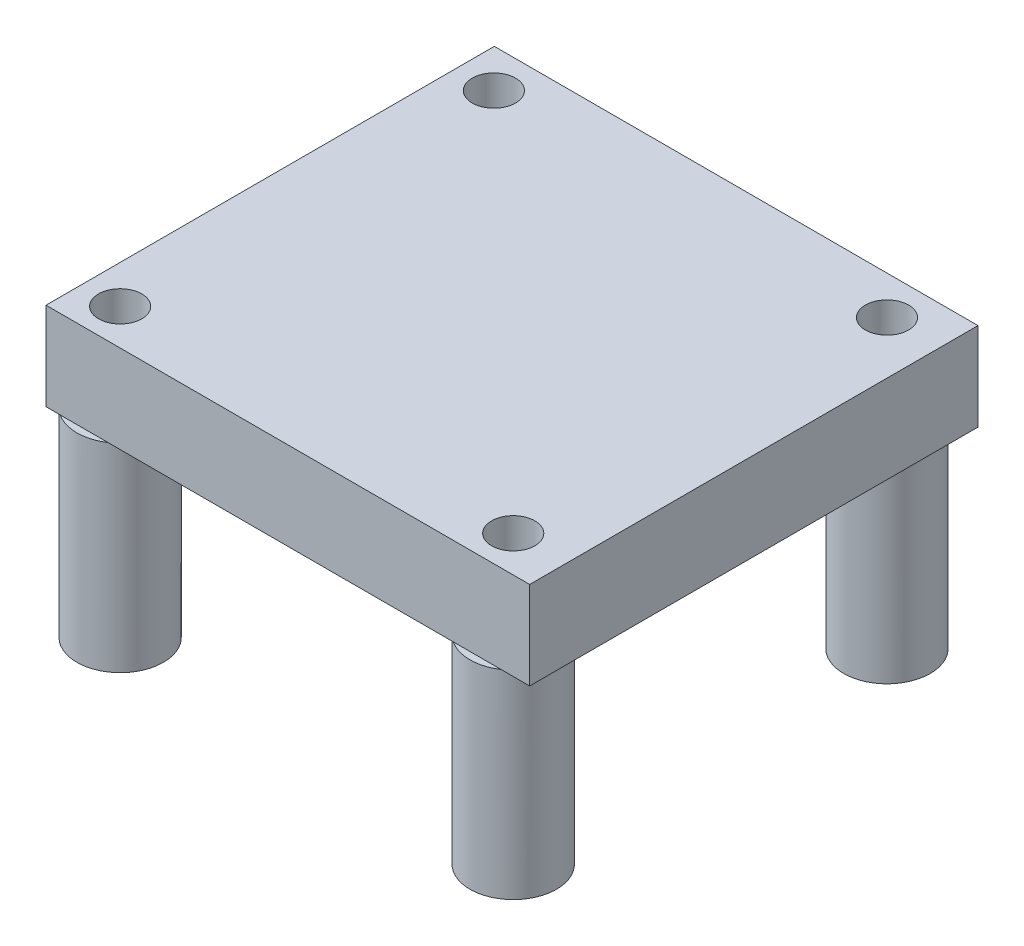
ISO-10303-21;
HEADER;
FILE_DESCRIPTION(('STEP AP214'),'2;1');
FILE_NAME('part.step','',(''),(''),'','','');
FILE_SCHEMA(('AUTOMOTIVE_DESIGN { 1 0 10303 214 1 1 1 1 }'));
ENDSEC;
DATA;
#1=APPLICATION_CONTEXT('core data for automotive mechanical design processes');
#2=APPLICATION_PROTOCOL_DEFINITION('international standard','automotive_design',2000,#1);
#3=PRODUCT_CONTEXT('',#1,'mechanical');
#4=PRODUCT('Part','Part','',(#3));
#5=PRODUCT_RELATED_PRODUCT_CATEGORY('part','',(#4));
#6=PRODUCT_DEFINITION_FORMATION('','',#4);
#7=PRODUCT_DEFINITION_CONTEXT('part definition',#1,'design');
#8=PRODUCT_DEFINITION('design','',#6,#7);
#9=PRODUCT_DEFINITION_SHAPE('','',#8);
#10=(LENGTH_UNIT() NAMED_UNIT(*) SI_UNIT(.MILLI.,.METRE.));
#11=(NAMED_UNIT(*) PLANE_ANGLE_UNIT() SI_UNIT($,.RADIAN.));
#12=(NAMED_UNIT(*) SI_UNIT($,.STERADIAN.) SOLID_ANGLE_UNIT());
#13=UNCERTAINTY_MEASURE_WITH_UNIT(LENGTH_MEASURE(1.E-05),#10,'distance_accuracy_value','');
#14=(GEOMETRIC_REPRESENTATION_CONTEXT(3) GLOBAL_UNCERTAINTY_ASSIGNED_CONTEXT((#13)) GLOBAL_UNIT_ASSIGNED_CONTEXT((#10,
#11,#12)) REPRESENTATION_CONTEXT('',''));
#15=CARTESIAN_POINT('',(0.,0.,0.));
#16=DIRECTION('',(0.,0.,1.));
#17=DIRECTION('',(1.,0.,0.));
#18=AXIS2_PLACEMENT_3D('',#15,#16,#17);
#19=CARTESIAN_POINT('',(0.,0.,0.));
#20=DIRECTION('',(0.,1.,0.));
#21=DIRECTION('',(0.,0.,1.));
#22=AXIS2_PLACEMENT_3D('',#19,#20,#21);
#23=PLANE('',#22);
#24=CARTESIAN_POINT('',(-9.08269961067136,0.,-8.40305308869703));
#25=DIRECTION('',(0.,1.,0.));
#26=DIRECTION('',(0.,0.,1.));
#27=AXIS2_PLACEMENT_3D('',#24,#25,#26);
#28=CIRCLE('',#27,2.5);
#29=CARTESIAN_POINT('',(-11.2828992805755,0.,-9.59011728769957));
#30=VERTEX_POINT('',#29);
#31=CARTESIAN_POINT('',(-10.2204199898374,0.,-10.6291690647482));
#32=VERTEX_POINT('',#31);
#33=EDGE_CURVE('E11',#30,#32,#28,.F.);
#34=ORIENTED_EDGE('',*,*,#33,.F.);
#35=DIRECTION('',(0.,0.,1.));
#36=VECTOR('',#35,1.);
#37=CARTESIAN_POINT('',(-11.2828992805755,0.,-10.6291690647482));
#38=LINE('',#37,#36);
#39=CARTESIAN_POINT('',(-11.2828992805755,0.,-10.6291690647482));
#40=VERTEX_POINT('',#39);
#41=EDGE_CURVE('E185',#40,#30,#38,.T.);
#42=ORIENTED_EDGE('',*,*,#41,.F.);
#43=DIRECTION('',(-1.,0.,0.));
#44=VECTOR('',#43,1.);
#45=CARTESIAN_POINT('',(-11.2828992805755,0.,-10.6291690647482));
#46=LINE('',#45,#44);
#47=EDGE_CURVE('E59',#32,#40,#46,.T.);
#48=ORIENTED_EDGE('',*,*,#47,.F.);
#49=EDGE_LOOP('',(#34,#42,#48));
#50=FACE_BOUND('',#49,.T.);
#51=ADVANCED_FACE('F36',(#50),#23,.F.);
#52=CARTESIAN_POINT('',(-9.08269961067136,0.,13.186946911303));
#53=DIRECTION('',(0.,-1.,0.));
#54=DIRECTION('',(0.,0.,-1.));
#55=AXIS2_PLACEMENT_3D('',#52,#53,#54);
#56=CIRCLE('',#55,2.5);
#57=CARTESIAN_POINT('',(-10.4637960500017,0.,15.2708309352518));
#58=VERTEX_POINT('',#57);
#59=CARTESIAN_POINT('',(-11.2828992805755,0.,14.3740111103055));
#60=VERTEX_POINT('',#59);
#61=EDGE_CURVE('E208',#58,#60,#56,.T.);
#62=ORIENTED_EDGE('',*,*,#61,.F.);
#63=DIRECTION('',(1.,0.,0.));
#64=VECTOR('',#63,1.);
#65=CARTESIAN_POINT('',(-11.2828992805755,0.,15.2708309352518));
#66=LINE('',#65,#64);
#67=CARTESIAN_POINT('',(-11.2828992805755,0.,15.2708309352518));
#68=VERTEX_POINT('',#67);
#69=EDGE_CURVE('E192',#68,#58,#66,.T.);
#70=ORIENTED_EDGE('',*,*,#69,.F.);
#71=EDGE_CURVE('E170',#60,#68,#38,.T.);
#72=ORIENTED_EDGE('',*,*,#71,.F.);
#73=EDGE_LOOP('',(#62,#70,#72));
#74=FACE_BOUND('',#73,.T.);
#75=ADVANCED_FACE('F242',(#74),#23,.F.);
#76=CARTESIAN_POINT('',(-11.2828992805755,5.08,-10.6291690647482));
#77=DIRECTION('',(1.,0.,0.));
#78=DIRECTION('',(0.,0.,-1.));
#79=AXIS2_PLACEMENT_3D('',#76,#77,#78);
#80=PLANE('',#79);
#81=ORIENTED_EDGE('',*,*,#41,.T.);
#82=CARTESIAN_POINT('',(-11.2828992805755,0.,-7.21598888969449));
#83=VERTEX_POINT('',#82);
#84=EDGE_CURVE('E189',#30,#83,#38,.T.);
#85=ORIENTED_EDGE('',*,*,#84,.T.);
#86=CARTESIAN_POINT('',(-11.2828992805755,0.,11.9998827123004));
#87=VERTEX_POINT('',#86);
#88=EDGE_CURVE('E190',#83,#87,#38,.T.);
#89=ORIENTED_EDGE('',*,*,#88,.T.);
#90=EDGE_CURVE('E191',#87,#60,#38,.T.);
#91=ORIENTED_EDGE('',*,*,#90,.T.);
#92=ORIENTED_EDGE('',*,*,#71,.T.);
#93=DIRECTION('',(0.,-1.,0.));
#94=VECTOR('',#93,1.);
#95=CARTESIAN_POINT('',(-11.2828992805755,5.08,15.2708309352518));
#96=LINE('',#95,#94);
#97=CARTESIAN_POINT('',(-11.2828992805755,5.08,15.2708309352518));
#98=VERTEX_POINT('',#97);
#99=EDGE_CURVE('E205',#98,#68,#96,.T.);
#100=ORIENTED_EDGE('',*,*,#99,.F.);
#101=DIRECTION('',(0.,0.,1.));
#102=VECTOR('',#101,1.);
#103=CARTESIAN_POINT('',(-11.2828992805755,5.08,-10.6291690647482));
#104=LINE('',#103,#102);
#105=CARTESIAN_POINT('',(-11.2828992805755,5.08,-10.6291690647482));
#106=VERTEX_POINT('',#105);
#107=EDGE_CURVE('E175',#106,#98,#104,.T.);
#108=ORIENTED_EDGE('',*,*,#107,.F.);
#109=DIRECTION('',(0.,-1.,0.));
#110=VECTOR('',#109,1.);
#111=CARTESIAN_POINT('',(-11.2828992805755,5.08,-10.6291690647482));
#112=LINE('',#111,#110);
#113=EDGE_CURVE('E184',#106,#40,#112,.T.);
#114=ORIENTED_EDGE('',*,*,#113,.T.);
#115=EDGE_LOOP('',(#81,#85,#89,#91,#92,#100,#108,#114));
#116=FACE_BOUND('',#115,.T.);
#117=ADVANCED_FACE('F38',(#116),#80,.F.);
#118=CARTESIAN_POINT('',(-11.2828992805755,5.08,15.2708309352518));
#119=DIRECTION('',(0.,0.,-1.));
#120=DIRECTION('',(-1.,0.,0.));
#121=AXIS2_PLACEMENT_3D('',#118,#119,#120);
#122=PLANE('',#121);
#123=ORIENTED_EDGE('',*,*,#69,.T.);
#124=CARTESIAN_POINT('',(-7.70160317134106,0.,15.2708309352518));
#125=VERTEX_POINT('',#124);
#126=EDGE_CURVE('E196',#58,#125,#66,.T.);
#127=ORIENTED_EDGE('',*,*,#126,.T.);
#128=CARTESIAN_POINT('',(12.2438039499983,0.,15.2708309352518));
#129=VERTEX_POINT('',#128);
#130=EDGE_CURVE('E353',#125,#129,#66,.T.);
#131=ORIENTED_EDGE('',*,*,#130,.T.);
#132=CARTESIAN_POINT('',(15.0059968286589,0.,15.2708309352518));
#133=VERTEX_POINT('',#132);
#134=EDGE_CURVE('E352',#129,#133,#66,.T.);
#135=ORIENTED_EDGE('',*,*,#134,.T.);
#136=CARTESIAN_POINT('',(16.6571007194245,0.,15.2708309352518));
#137=VERTEX_POINT('',#136);
#138=EDGE_CURVE('E188',#133,#137,#66,.T.);
#139=ORIENTED_EDGE('',*,*,#138,.T.);
#140=DIRECTION('',(0.,-1.,0.));
#141=VECTOR('',#140,1.);
#142=CARTESIAN_POINT('',(16.6571007194245,5.08,15.2708309352518));
#143=LINE('',#142,#141);
#144=CARTESIAN_POINT('',(16.6571007194245,5.08,15.2708309352518));
#145=VERTEX_POINT('',#144);
#146=EDGE_CURVE('E202',#145,#137,#143,.T.);
#147=ORIENTED_EDGE('',*,*,#146,.F.);
#148=DIRECTION('',(1.,0.,0.));
#149=VECTOR('',#148,1.);
#150=CARTESIAN_POINT('',(-11.2828992805755,5.08,15.2708309352518));
#151=LINE('',#150,#149);
#152=EDGE_CURVE('E178',#98,#145,#151,.T.);
#153=ORIENTED_EDGE('',*,*,#152,.F.);
#154=ORIENTED_EDGE('',*,*,#99,.T.);
#155=EDGE_LOOP('',(#123,#127,#131,#135,#139,#147,#153,#154));
#156=FACE_BOUND('',#155,.T.);
#157=ADVANCED_FACE('F344',(#156),#122,.F.);
#158=CARTESIAN_POINT('',(16.6571007194245,5.08,-10.6291690647482));
#159=DIRECTION('',(-1.,0.,0.));
#160=DIRECTION('',(0.,0.,1.));
#161=AXIS2_PLACEMENT_3D('',#158,#159,#160);
#162=PLANE('',#161);
#163=DIRECTION('',(0.,0.,-1.));
#164=VECTOR('',#163,1.);
#165=CARTESIAN_POINT('',(16.6571007194245,0.,-10.6291690647482));
#166=LINE('',#165,#164);
#167=CARTESIAN_POINT('',(16.6571007194245,0.,-10.6291690647482));
#168=VERTEX_POINT('',#167);
#169=EDGE_CURVE('E195',#137,#168,#166,.T.);
#170=ORIENTED_EDGE('',*,*,#169,.T.);
#171=DIRECTION('',(0.,-1.,0.));
#172=VECTOR('',#171,1.);
#173=CARTESIAN_POINT('',(16.6571007194245,5.08,-10.6291690647482));
#174=LINE('',#173,#172);
#175=CARTESIAN_POINT('',(16.6571007194245,5.08,-10.6291690647482));
#176=VERTEX_POINT('',#175);
#177=EDGE_CURVE('E200',#176,#168,#174,.T.);
#178=ORIENTED_EDGE('',*,*,#177,.F.);
#179=DIRECTION('',(0.,0.,-1.));
#180=VECTOR('',#179,1.);
#181=CARTESIAN_POINT('',(16.6571007194245,5.08,-10.6291690647482));
#182=LINE('',#181,#180);
#183=EDGE_CURVE('E180',#145,#176,#182,.T.);
#184=ORIENTED_EDGE('',*,*,#183,.F.);
#185=ORIENTED_EDGE('',*,*,#146,.T.);
#186=EDGE_LOOP('',(#170,#178,#184,#185));
#187=FACE_BOUND('',#186,.T.);
#188=ADVANCED_FACE('F263',(#187),#162,.F.);
#189=CARTESIAN_POINT('',(-11.2828992805755,5.08,-10.6291690647482));
#190=DIRECTION('',(0.,0.,1.));
#191=DIRECTION('',(1.,0.,0.));
#192=AXIS2_PLACEMENT_3D('',#189,#190,#191);
#193=PLANE('',#192);
#194=CARTESIAN_POINT('',(14.7626207684947,0.,-10.6291690647482));
#195=VERTEX_POINT('',#194);
#196=EDGE_CURVE('E119',#168,#195,#46,.T.);
#197=ORIENTED_EDGE('',*,*,#196,.T.);
#198=CARTESIAN_POINT('',(12.4871800101626,0.,-10.6291690647482));
#199=VERTEX_POINT('',#198);
#200=EDGE_CURVE('E114',#195,#199,#46,.T.);
#201=ORIENTED_EDGE('',*,*,#200,.T.);
#202=CARTESIAN_POINT('',(-7.94497923150531,0.,-10.6291690647482));
#203=VERTEX_POINT('',#202);
#204=EDGE_CURVE('E116',#199,#203,#46,.T.);
#205=ORIENTED_EDGE('',*,*,#204,.T.);
#206=EDGE_CURVE('E129',#203,#32,#46,.T.);
#207=ORIENTED_EDGE('',*,*,#206,.T.);
#208=ORIENTED_EDGE('',*,*,#47,.T.);
#209=ORIENTED_EDGE('',*,*,#113,.F.);
#210=DIRECTION('',(-1.,0.,0.));
#211=VECTOR('',#210,1.);
#212=CARTESIAN_POINT('',(-11.2828992805755,5.08,-10.6291690647482));
#213=LINE('',#212,#211);
#214=EDGE_CURVE('E182',#176,#106,#213,.T.);
#215=ORIENTED_EDGE('',*,*,#214,.F.);
#216=ORIENTED_EDGE('',*,*,#177,.T.);
#217=EDGE_LOOP('',(#197,#201,#205,#207,#208,#209,#215,#216));
#218=FACE_BOUND('',#217,.T.);
#219=ADVANCED_FACE('F115',(#218),#193,.F.);
#220=CARTESIAN_POINT('',(0.,5.08,0.));
#221=DIRECTION('',(0.,1.,0.));
#222=DIRECTION('',(0.,0.,1.));
#223=AXIS2_PLACEMENT_3D('',#220,#221,#222);
#224=PLANE('',#223);
#225=CARTESIAN_POINT('',(-9.08269961067136,5.08,-8.40305308869703));
#226=DIRECTION('',(0.,1.,0.));
#227=DIRECTION('',(0.,0.,1.));
#228=AXIS2_PLACEMENT_3D('',#225,#226,#227);
#229=CIRCLE('',#228,1.25);
#230=CARTESIAN_POINT('',(-9.08269961067136,5.08,-7.15305308869703));
#231=VERTEX_POINT('',#230);
#232=EDGE_CURVE('E329',#231,#231,#229,.T.);
#233=ORIENTED_EDGE('',*,*,#232,.F.);
#234=EDGE_LOOP('',(#233));
#235=FACE_BOUND('',#234,.T.);
#236=CARTESIAN_POINT('',(13.6249003893286,5.08,13.186946911303));
#237=DIRECTION('',(0.,1.,0.));
#238=DIRECTION('',(0.,0.,1.));
#239=AXIS2_PLACEMENT_3D('',#236,#237,#238);
#240=CIRCLE('',#239,1.25);
#241=CARTESIAN_POINT('',(13.6249003893286,5.08,14.436946911303));
#242=VERTEX_POINT('',#241);
#243=EDGE_CURVE('E331',#242,#242,#240,.T.);
#244=ORIENTED_EDGE('',*,*,#243,.F.);
#245=EDGE_LOOP('',(#244));
#246=FACE_BOUND('',#245,.T.);
#247=CARTESIAN_POINT('',(-9.08269961067136,5.08,13.186946911303));
#248=DIRECTION('',(0.,1.,0.));
#249=DIRECTION('',(0.,0.,1.));
#250=AXIS2_PLACEMENT_3D('',#247,#248,#249);
#251=CIRCLE('',#250,1.25);
#252=CARTESIAN_POINT('',(-9.08269961067136,5.08,14.436946911303));
#253=VERTEX_POINT('',#252);
#254=EDGE_CURVE('E335',#253,#253,#251,.T.);
#255=ORIENTED_EDGE('',*,*,#254,.F.);
#256=EDGE_LOOP('',(#255));
#257=FACE_BOUND('',#256,.T.);
#258=CARTESIAN_POINT('',(13.6249003893286,5.08,-8.40305308869703));
#259=DIRECTION('',(0.,1.,0.));
#260=DIRECTION('',(0.,0.,1.));
#261=AXIS2_PLACEMENT_3D('',#258,#259,#260);
#262=CIRCLE('',#261,1.25);
#263=CARTESIAN_POINT('',(13.6249003893286,5.08,-7.15305308869703));
#264=VERTEX_POINT('',#263);
#265=EDGE_CURVE('E142',#264,#264,#262,.T.);
#266=ORIENTED_EDGE('',*,*,#265,.F.);
#267=EDGE_LOOP('',(#266));
#268=FACE_BOUND('',#267,.T.);
#269=ORIENTED_EDGE('',*,*,#107,.T.);
#270=ORIENTED_EDGE('',*,*,#152,.T.);
#271=ORIENTED_EDGE('',*,*,#183,.T.);
#272=ORIENTED_EDGE('',*,*,#214,.T.);
#273=EDGE_LOOP('',(#269,#270,#271,#272));
#274=FACE_BOUND('',#273,.T.);
#275=ADVANCED_FACE('F251',(#235,#246,#257,#268,#274),#224,.T.);
#276=CARTESIAN_POINT('',(13.6249003893286,0.,-8.40305308869703));
#277=DIRECTION('',(0.,-1.,0.));
#278=DIRECTION('',(0.,0.,-1.));
#279=AXIS2_PLACEMENT_3D('',#276,#277,#278);
#280=CIRCLE('',#279,2.5);
#281=EDGE_CURVE('E51',#195,#199,#280,.T.);
#282=ORIENTED_EDGE('',*,*,#281,.F.);
#283=ORIENTED_EDGE('',*,*,#196,.F.);
#284=ORIENTED_EDGE('',*,*,#169,.F.);
#285=ORIENTED_EDGE('',*,*,#138,.F.);
#286=CARTESIAN_POINT('',(13.6249003893286,0.,13.186946911303));
#287=DIRECTION('',(0.,1.,0.));
#288=DIRECTION('',(0.,0.,1.));
#289=AXIS2_PLACEMENT_3D('',#286,#287,#288);
#290=CIRCLE('',#289,2.5);
#291=EDGE_CURVE('E44',#129,#133,#290,.F.);
#292=ORIENTED_EDGE('',*,*,#291,.F.);
#293=ORIENTED_EDGE('',*,*,#130,.F.);
#294=EDGE_CURVE('E174',#87,#125,#56,.T.);
#295=ORIENTED_EDGE('',*,*,#294,.F.);
#296=ORIENTED_EDGE('',*,*,#88,.F.);
#297=CARTESIAN_POINT('',(-9.08269961067136,0.,-8.40305308869703));
#298=DIRECTION('',(0.,-1.,0.));
#299=DIRECTION('',(0.,0.,-1.));
#300=AXIS2_PLACEMENT_3D('',#297,#298,#299);
#301=CIRCLE('',#300,2.5);
#302=EDGE_CURVE('E127',#203,#83,#301,.T.);
#303=ORIENTED_EDGE('',*,*,#302,.F.);
#304=ORIENTED_EDGE('',*,*,#204,.F.);
#305=EDGE_LOOP('',(#282,#283,#284,#285,#292,#293,#295,#296,#303,#304));
#306=FACE_BOUND('',#305,.T.);
#307=ADVANCED_FACE('F124',(#306),#23,.F.);
#308=CARTESIAN_POINT('',(-9.08269961067136,0.,13.186946911303));
#309=DIRECTION('',(0.,-1.,0.));
#310=DIRECTION('',(0.,0.,-1.));
#311=AXIS2_PLACEMENT_3D('',#308,#309,#310);
#312=PLANE('',#311);
#313=ORIENTED_EDGE('',*,*,#90,.F.);
#314=EDGE_CURVE('E166',#60,#87,#56,.T.);
#315=ORIENTED_EDGE('',*,*,#314,.F.);
#316=EDGE_LOOP('',(#313,#315));
#317=FACE_BOUND('',#316,.T.);
#318=ADVANCED_FACE('F221',(#317),#312,.F.);
#319=CARTESIAN_POINT('',(-9.08269961067136,-11.4808,13.186946911303));
#320=DIRECTION('',(0.,-1.,0.));
#321=DIRECTION('',(0.,0.,-1.));
#322=AXIS2_PLACEMENT_3D('',#319,#320,#321);
#323=PLANE('',#322);
#324=CARTESIAN_POINT('',(-9.08269961067136,-11.4808,13.186946911303));
#325=DIRECTION('',(0.,-1.,0.));
#326=DIRECTION('',(0.,0.,-1.));
#327=AXIS2_PLACEMENT_3D('',#324,#325,#326);
#328=CIRCLE('',#327,2.5);
#329=CARTESIAN_POINT('',(-9.08269961067136,-11.4808,10.686946911303));
#330=VERTEX_POINT('',#329);
#331=EDGE_CURVE('E167',#330,#330,#328,.T.);
#332=ORIENTED_EDGE('',*,*,#331,.T.);
#333=EDGE_LOOP('',(#332));
#334=FACE_BOUND('',#333,.T.);
#335=CARTESIAN_POINT('',(-9.08269961067136,-11.4808,13.186946911303));
#336=DIRECTION('',(0.,-1.,0.));
#337=DIRECTION('',(0.,0.,-1.));
#338=AXIS2_PLACEMENT_3D('',#335,#336,#337);
#339=CIRCLE('',#338,1.25);
#340=CARTESIAN_POINT('',(-9.08269961067136,-11.4808,11.936946911303));
#341=VERTEX_POINT('',#340);
#342=EDGE_CURVE('E163',#341,#341,#339,.T.);
#343=ORIENTED_EDGE('',*,*,#342,.F.);
#344=EDGE_LOOP('',(#343));
#345=FACE_BOUND('',#344,.T.);
#346=ADVANCED_FACE('F256',(#334,#345),#323,.T.);
#347=ORIENTED_EDGE('',*,*,#126,.F.);
#348=EDGE_CURVE('E171',#125,#58,#56,.T.);
#349=ORIENTED_EDGE('',*,*,#348,.F.);
#350=EDGE_LOOP('',(#347,#349));
#351=FACE_BOUND('',#350,.T.);
#352=ADVANCED_FACE('F258',(#351),#312,.F.);
#353=CARTESIAN_POINT('',(-9.08269961067136,-11.4808,13.186946911303));
#354=DIRECTION('',(0.,1.,0.));
#355=DIRECTION('',(0.,0.,1.));
#356=AXIS2_PLACEMENT_3D('',#353,#354,#355);
#357=CYLINDRICAL_SURFACE('',#356,2.5);
#358=ORIENTED_EDGE('',*,*,#331,.F.);
#359=EDGE_LOOP('',(#358));
#360=FACE_BOUND('',#359,.T.);
#361=ORIENTED_EDGE('',*,*,#348,.T.);
#362=ORIENTED_EDGE('',*,*,#61,.T.);
#363=ORIENTED_EDGE('',*,*,#314,.T.);
#364=ORIENTED_EDGE('',*,*,#294,.T.);
#365=EDGE_LOOP('',(#361,#362,#363,#364));
#366=FACE_BOUND('',#365,.T.);
#367=ADVANCED_FACE('F216',(#360,#366),#357,.T.);
#368=CARTESIAN_POINT('',(-9.08269961067136,-11.4808,13.186946911303));
#369=DIRECTION('',(0.,1.,0.));
#370=DIRECTION('',(0.,0.,1.));
#371=AXIS2_PLACEMENT_3D('',#368,#369,#370);
#372=CYLINDRICAL_SURFACE('',#371,1.25);
#373=ORIENTED_EDGE('',*,*,#342,.T.);
#374=EDGE_LOOP('',(#373));
#375=FACE_BOUND('',#374,.T.);
#376=ORIENTED_EDGE('',*,*,#254,.T.);
#377=EDGE_LOOP('',(#376));
#378=FACE_BOUND('',#377,.T.);
#379=ADVANCED_FACE('F268',(#375,#378),#372,.F.);
#380=CARTESIAN_POINT('',(13.6249003893286,0.,13.186946911303));
#381=DIRECTION('',(0.,-1.,0.));
#382=DIRECTION('',(0.,0.,-1.));
#383=AXIS2_PLACEMENT_3D('',#380,#381,#382);
#384=PLANE('',#383);
#385=CARTESIAN_POINT('',(13.6249003893286,0.,13.186946911303));
#386=DIRECTION('',(0.,-1.,0.));
#387=DIRECTION('',(0.,0.,-1.));
#388=AXIS2_PLACEMENT_3D('',#385,#386,#387);
#389=CIRCLE('',#388,2.5);
#390=EDGE_CURVE('E155',#133,#129,#389,.T.);
#391=ORIENTED_EDGE('',*,*,#390,.F.);
#392=ORIENTED_EDGE('',*,*,#134,.F.);
#393=EDGE_LOOP('',(#391,#392));
#394=FACE_BOUND('',#393,.T.);
#395=ADVANCED_FACE('F278',(#394),#384,.F.);
#396=CARTESIAN_POINT('',(13.6249003893286,-11.4808,13.186946911303));
#397=DIRECTION('',(0.,-1.,0.));
#398=DIRECTION('',(0.,0.,-1.));
#399=AXIS2_PLACEMENT_3D('',#396,#397,#398);
#400=PLANE('',#399);
#401=CARTESIAN_POINT('',(13.6249003893286,-11.4808,13.186946911303));
#402=DIRECTION('',(0.,-1.,0.));
#403=DIRECTION('',(0.,0.,-1.));
#404=AXIS2_PLACEMENT_3D('',#401,#402,#403);
#405=CIRCLE('',#404,2.5);
#406=CARTESIAN_POINT('',(13.6249003893286,-11.4808,10.686946911303));
#407=VERTEX_POINT('',#406);
#408=EDGE_CURVE('E154',#407,#407,#405,.T.);
#409=ORIENTED_EDGE('',*,*,#408,.T.);
#410=EDGE_LOOP('',(#409));
#411=FACE_BOUND('',#410,.T.);
#412=CARTESIAN_POINT('',(13.6249003893286,-11.4808,13.186946911303));
#413=DIRECTION('',(0.,-1.,0.));
#414=DIRECTION('',(0.,0.,-1.));
#415=AXIS2_PLACEMENT_3D('',#412,#413,#414);
#416=CIRCLE('',#415,1.25);
#417=CARTESIAN_POINT('',(13.6249003893286,-11.4808,11.936946911303));
#418=VERTEX_POINT('',#417);
#419=EDGE_CURVE('E158',#418,#418,#416,.T.);
#420=ORIENTED_EDGE('',*,*,#419,.F.);
#421=EDGE_LOOP('',(#420));
#422=FACE_BOUND('',#421,.T.);
#423=ADVANCED_FACE('F285',(#411,#422),#400,.T.);
#424=CARTESIAN_POINT('',(13.6249003893286,-11.4808,13.186946911303));
#425=DIRECTION('',(0.,1.,0.));
#426=DIRECTION('',(0.,0.,1.));
#427=AXIS2_PLACEMENT_3D('',#424,#425,#426);
#428=CYLINDRICAL_SURFACE('',#427,2.5);
#429=ORIENTED_EDGE('',*,*,#408,.F.);
#430=EDGE_LOOP('',(#429));
#431=FACE_BOUND('',#430,.T.);
#432=ORIENTED_EDGE('',*,*,#390,.T.);
#433=ORIENTED_EDGE('',*,*,#291,.T.);
#434=EDGE_LOOP('',(#432,#433));
#435=FACE_BOUND('',#434,.T.);
#436=ADVANCED_FACE('F283',(#431,#435),#428,.T.);
#437=CARTESIAN_POINT('',(13.6249003893286,-11.4808,13.186946911303));
#438=DIRECTION('',(0.,1.,0.));
#439=DIRECTION('',(0.,0.,1.));
#440=AXIS2_PLACEMENT_3D('',#437,#438,#439);
#441=CYLINDRICAL_SURFACE('',#440,1.25);
#442=ORIENTED_EDGE('',*,*,#419,.T.);
#443=EDGE_LOOP('',(#442));
#444=FACE_BOUND('',#443,.T.);
#445=ORIENTED_EDGE('',*,*,#243,.T.);
#446=EDGE_LOOP('',(#445));
#447=FACE_BOUND('',#446,.T.);
#448=ADVANCED_FACE('F280',(#444,#447),#441,.F.);
#449=CARTESIAN_POINT('',(-9.08269961067136,0.,-8.40305308869703));
#450=DIRECTION('',(0.,-1.,0.));
#451=DIRECTION('',(0.,0.,-1.));
#452=AXIS2_PLACEMENT_3D('',#449,#450,#451);
#453=PLANE('',#452);
#454=EDGE_CURVE('E148',#83,#30,#301,.T.);
#455=ORIENTED_EDGE('',*,*,#454,.F.);
#456=ORIENTED_EDGE('',*,*,#84,.F.);
#457=EDGE_LOOP('',(#455,#456));
#458=FACE_BOUND('',#457,.T.);
#459=ADVANCED_FACE('F231',(#458),#453,.F.);
#460=EDGE_CURVE('E149',#32,#203,#301,.T.);
#461=ORIENTED_EDGE('',*,*,#460,.F.);
#462=ORIENTED_EDGE('',*,*,#206,.F.);
#463=EDGE_LOOP('',(#461,#462));
#464=FACE_BOUND('',#463,.T.);
#465=ADVANCED_FACE('F237',(#464),#453,.F.);
#466=CARTESIAN_POINT('',(-9.08269961067136,-11.4808,-8.40305308869703));
#467=DIRECTION('',(0.,-1.,0.));
#468=DIRECTION('',(0.,0.,-1.));
#469=AXIS2_PLACEMENT_3D('',#466,#467,#468);
#470=PLANE('',#469);
#471=CARTESIAN_POINT('',(-9.08269961067136,-11.4808,-8.40305308869703));
#472=DIRECTION('',(0.,-1.,0.));
#473=DIRECTION('',(0.,0.,-1.));
#474=AXIS2_PLACEMENT_3D('',#471,#472,#473);
#475=CIRCLE('',#474,2.5);
#476=CARTESIAN_POINT('',(-9.08269961067136,-11.4808,-10.903053088697));
#477=VERTEX_POINT('',#476);
#478=EDGE_CURVE('E138',#477,#477,#475,.T.);
#479=ORIENTED_EDGE('',*,*,#478,.T.);
#480=EDGE_LOOP('',(#479));
#481=FACE_BOUND('',#480,.T.);
#482=CARTESIAN_POINT('',(-9.08269961067136,-11.4808,-8.40305308869703));
#483=DIRECTION('',(0.,-1.,0.));
#484=DIRECTION('',(0.,0.,-1.));
#485=AXIS2_PLACEMENT_3D('',#482,#483,#484);
#486=CIRCLE('',#485,1.25);
#487=CARTESIAN_POINT('',(-9.08269961067136,-11.4808,-9.65305308869703));
#488=VERTEX_POINT('',#487);
#489=EDGE_CURVE('E147',#488,#488,#486,.T.);
#490=ORIENTED_EDGE('',*,*,#489,.F.);
#491=EDGE_LOOP('',(#490));
#492=FACE_BOUND('',#491,.T.);
#493=ADVANCED_FACE('F299',(#481,#492),#470,.T.);
#494=CARTESIAN_POINT('',(-9.08269961067136,-11.4808,-8.40305308869703));
#495=DIRECTION('',(0.,1.,0.));
#496=DIRECTION('',(0.,0.,1.));
#497=AXIS2_PLACEMENT_3D('',#494,#495,#496);
#498=CYLINDRICAL_SURFACE('',#497,2.5);
#499=ORIENTED_EDGE('',*,*,#478,.F.);
#500=EDGE_LOOP('',(#499));
#501=FACE_BOUND('',#500,.T.);
#502=ORIENTED_EDGE('',*,*,#302,.T.);
#503=ORIENTED_EDGE('',*,*,#454,.T.);
#504=ORIENTED_EDGE('',*,*,#33,.T.);
#505=ORIENTED_EDGE('',*,*,#460,.T.);
#506=EDGE_LOOP('',(#502,#503,#504,#505));
#507=FACE_BOUND('',#506,.T.);
#508=ADVANCED_FACE('F234',(#501,#507),#498,.T.);
#509=CARTESIAN_POINT('',(-9.08269961067136,-11.4808,-8.40305308869703));
#510=DIRECTION('',(0.,1.,0.));
#511=DIRECTION('',(0.,0.,1.));
#512=AXIS2_PLACEMENT_3D('',#509,#510,#511);
#513=CYLINDRICAL_SURFACE('',#512,1.25);
#514=ORIENTED_EDGE('',*,*,#489,.T.);
#515=EDGE_LOOP('',(#514));
#516=FACE_BOUND('',#515,.T.);
#517=ORIENTED_EDGE('',*,*,#232,.T.);
#518=EDGE_LOOP('',(#517));
#519=FACE_BOUND('',#518,.T.);
#520=ADVANCED_FACE('F295',(#516,#519),#513,.F.);
#521=CARTESIAN_POINT('',(13.6249003893286,0.,-8.40305308869703));
#522=DIRECTION('',(0.,-1.,0.));
#523=DIRECTION('',(0.,0.,-1.));
#524=AXIS2_PLACEMENT_3D('',#521,#522,#523);
#525=PLANE('',#524);
#526=EDGE_CURVE('E130',#199,#195,#280,.T.);
#527=ORIENTED_EDGE('',*,*,#526,.F.);
#528=ORIENTED_EDGE('',*,*,#200,.F.);
#529=EDGE_LOOP('',(#527,#528));
#530=FACE_BOUND('',#529,.T.);
#531=ADVANCED_FACE('F131',(#530),#525,.F.);
#532=CARTESIAN_POINT('',(13.6249003893286,-11.4808,-8.40305308869703));
#533=DIRECTION('',(0.,-1.,0.));
#534=DIRECTION('',(0.,0.,-1.));
#535=AXIS2_PLACEMENT_3D('',#532,#533,#534);
#536=PLANE('',#535);
#537=CARTESIAN_POINT('',(13.6249003893286,-11.4808,-8.40305308869703));
#538=DIRECTION('',(0.,-1.,0.));
#539=DIRECTION('',(0.,0.,-1.));
#540=AXIS2_PLACEMENT_3D('',#537,#538,#539);
#541=CIRCLE('',#540,2.5);
#542=CARTESIAN_POINT('',(13.6249003893286,-11.4808,-10.903053088697));
#543=VERTEX_POINT('',#542);
#544=EDGE_CURVE('E133',#543,#543,#541,.T.);
#545=ORIENTED_EDGE('',*,*,#544,.T.);
#546=EDGE_LOOP('',(#545));
#547=FACE_BOUND('',#546,.T.);
#548=CARTESIAN_POINT('',(13.6249003893286,-11.4808,-8.40305308869703));
#549=DIRECTION('',(0.,-1.,0.));
#550=DIRECTION('',(0.,0.,-1.));
#551=AXIS2_PLACEMENT_3D('',#548,#549,#550);
#552=CIRCLE('',#551,1.25);
#553=CARTESIAN_POINT('',(13.6249003893286,-11.4808,-9.65305308869703));
#554=VERTEX_POINT('',#553);
#555=EDGE_CURVE('E136',#554,#554,#552,.T.);
#556=ORIENTED_EDGE('',*,*,#555,.F.);
#557=EDGE_LOOP('',(#556));
#558=FACE_BOUND('',#557,.T.);
#559=ADVANCED_FACE('F312',(#547,#558),#536,.T.);
#560=CARTESIAN_POINT('',(13.6249003893286,-11.4808,-8.40305308869703));
#561=DIRECTION('',(0.,1.,0.));
#562=DIRECTION('',(0.,0.,1.));
#563=AXIS2_PLACEMENT_3D('',#560,#561,#562);
#564=CYLINDRICAL_SURFACE('',#563,2.5);
#565=ORIENTED_EDGE('',*,*,#544,.F.);
#566=EDGE_LOOP('',(#565));
#567=FACE_BOUND('',#566,.T.);
#568=ORIENTED_EDGE('',*,*,#281,.T.);
#569=ORIENTED_EDGE('',*,*,#526,.T.);
#570=EDGE_LOOP('',(#568,#569));
#571=FACE_BOUND('',#570,.T.);
#572=ADVANCED_FACE('F135',(#567,#571),#564,.T.);
#573=CARTESIAN_POINT('',(13.6249003893286,-11.4808,-8.40305308869703));
#574=DIRECTION('',(0.,1.,0.));
#575=DIRECTION('',(0.,0.,1.));
#576=AXIS2_PLACEMENT_3D('',#573,#574,#575);
#577=CYLINDRICAL_SURFACE('',#576,1.25);
#578=ORIENTED_EDGE('',*,*,#555,.T.);
#579=EDGE_LOOP('',(#578));
#580=FACE_BOUND('',#579,.T.);
#581=ORIENTED_EDGE('',*,*,#265,.T.);
#582=EDGE_LOOP('',(#581));
#583=FACE_BOUND('',#582,.T.);
#584=ADVANCED_FACE('F308',(#580,#583),#577,.F.);
#585=CLOSED_SHELL('',(#51,#75,#117,#157,#188,#219,#275,#307,#318,#346,#352,#367,#379,#395,#423,
#436,#448,#459,#465,#493,#508,#520,#531,#559,#572,#584));
#586=MANIFOLD_SOLID_BREP('B2',#585);
#587=ADVANCED_BREP_SHAPE_REPRESENTATION('',(#18,#586),#14);
#588=SHAPE_DEFINITION_REPRESENTATION(#9,#587);
ENDSEC;
END-ISO-10303-21;
